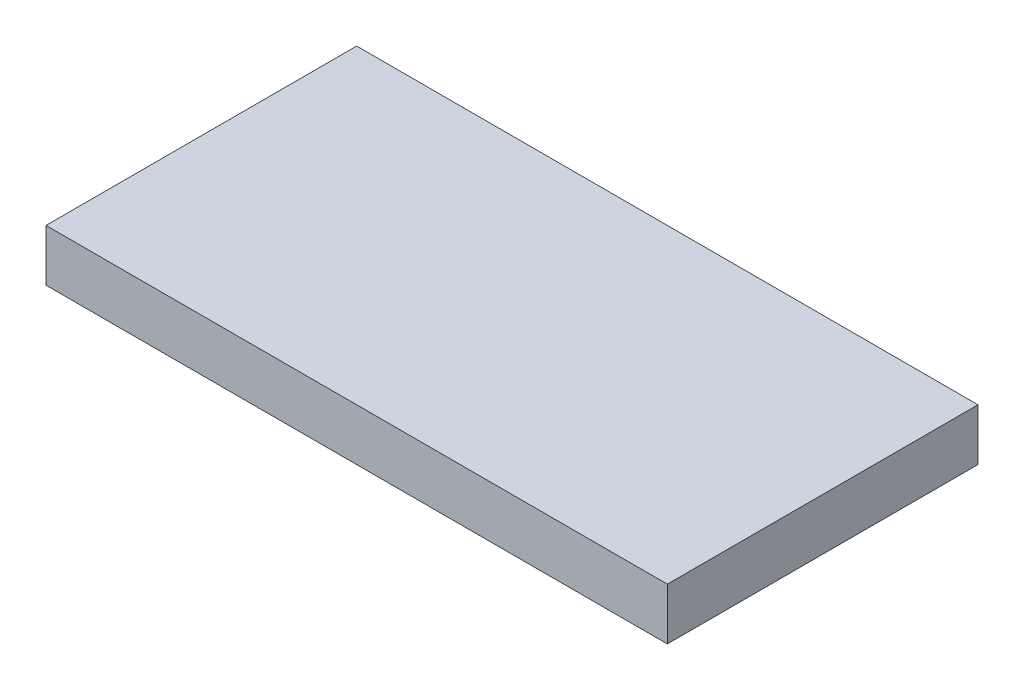
ISO-10303-21;
HEADER;
FILE_DESCRIPTION(('STEP AP214'),'2;1');
FILE_NAME('part.step','',(''),(''),'','','');
FILE_SCHEMA(('AUTOMOTIVE_DESIGN { 1 0 10303 214 1 1 1 1 }'));
ENDSEC;
DATA;
#1=APPLICATION_CONTEXT('core data for automotive mechanical design processes');
#2=APPLICATION_PROTOCOL_DEFINITION('international standard','automotive_design',2000,#1);
#3=PRODUCT_CONTEXT('',#1,'mechanical');
#4=PRODUCT('Part','Part','',(#3));
#5=PRODUCT_RELATED_PRODUCT_CATEGORY('part','',(#4));
#6=PRODUCT_DEFINITION_FORMATION('','',#4);
#7=PRODUCT_DEFINITION_CONTEXT('part definition',#1,'design');
#8=PRODUCT_DEFINITION('design','',#6,#7);
#9=PRODUCT_DEFINITION_SHAPE('','',#8);
#10=(LENGTH_UNIT() NAMED_UNIT(*) SI_UNIT(.MILLI.,.METRE.));
#11=(NAMED_UNIT(*) PLANE_ANGLE_UNIT() SI_UNIT($,.RADIAN.));
#12=(NAMED_UNIT(*) SI_UNIT($,.STERADIAN.) SOLID_ANGLE_UNIT());
#13=UNCERTAINTY_MEASURE_WITH_UNIT(LENGTH_MEASURE(1.E-05),#10,'distance_accuracy_value','');
#14=(GEOMETRIC_REPRESENTATION_CONTEXT(3) GLOBAL_UNCERTAINTY_ASSIGNED_CONTEXT((#13)) GLOBAL_UNIT_ASSIGNED_CONTEXT((#10,
#11,#12)) REPRESENTATION_CONTEXT('',''));
#15=CARTESIAN_POINT('',(0.,0.,0.));
#16=DIRECTION('',(0.,0.,1.));
#17=DIRECTION('',(1.,0.,0.));
#18=AXIS2_PLACEMENT_3D('',#15,#16,#17);
#19=CARTESIAN_POINT('',(-152.4,12.7,-76.2));
#20=DIRECTION('',(1.,0.,0.));
#21=DIRECTION('',(0.,0.,-1.));
#22=AXIS2_PLACEMENT_3D('',#19,#20,#21);
#23=PLANE('',#22);
#24=DIRECTION('',(0.,0.,1.));
#25=VECTOR('',#24,1.);
#26=CARTESIAN_POINT('',(-152.4,-12.7,-76.2));
#27=LINE('',#26,#25);
#28=CARTESIAN_POINT('',(-152.4,-12.7,-76.2));
#29=VERTEX_POINT('',#28);
#30=CARTESIAN_POINT('',(-152.4,-12.7,76.2));
#31=VERTEX_POINT('',#30);
#32=EDGE_CURVE('E96',#29,#31,#27,.T.);
#33=ORIENTED_EDGE('',*,*,#32,.T.);
#34=DIRECTION('',(0.,-1.,0.));
#35=VECTOR('',#34,1.);
#36=CARTESIAN_POINT('',(-152.4,12.7,76.2));
#37=LINE('',#36,#35);
#38=CARTESIAN_POINT('',(-152.4,12.7,76.2));
#39=VERTEX_POINT('',#38);
#40=EDGE_CURVE('E11',#39,#31,#37,.T.);
#41=ORIENTED_EDGE('',*,*,#40,.F.);
#42=DIRECTION('',(0.,0.,1.));
#43=VECTOR('',#42,1.);
#44=CARTESIAN_POINT('',(-152.4,12.7,-76.2));
#45=LINE('',#44,#43);
#46=CARTESIAN_POINT('',(-152.4,12.7,-76.2));
#47=VERTEX_POINT('',#46);
#48=EDGE_CURVE('E84',#47,#39,#45,.T.);
#49=ORIENTED_EDGE('',*,*,#48,.F.);
#50=DIRECTION('',(0.,-1.,0.));
#51=VECTOR('',#50,1.);
#52=CARTESIAN_POINT('',(-152.4,12.7,-76.2));
#53=LINE('',#52,#51);
#54=EDGE_CURVE('E92',#47,#29,#53,.T.);
#55=ORIENTED_EDGE('',*,*,#54,.T.);
#56=EDGE_LOOP('',(#33,#41,#49,#55));
#57=FACE_BOUND('',#56,.T.);
#58=ADVANCED_FACE('F33',(#57),#23,.F.);
#59=CARTESIAN_POINT('',(-152.4,12.7,76.2));
#60=DIRECTION('',(0.,0.,-1.));
#61=DIRECTION('',(-1.,0.,0.));
#62=AXIS2_PLACEMENT_3D('',#59,#60,#61);
#63=PLANE('',#62);
#64=DIRECTION('',(1.,0.,0.));
#65=VECTOR('',#64,1.);
#66=CARTESIAN_POINT('',(-152.4,-12.7,76.2));
#67=LINE('',#66,#65);
#68=CARTESIAN_POINT('',(152.4,-12.7,76.2));
#69=VERTEX_POINT('',#68);
#70=EDGE_CURVE('E88',#31,#69,#67,.T.);
#71=ORIENTED_EDGE('',*,*,#70,.T.);
#72=DIRECTION('',(0.,-1.,0.));
#73=VECTOR('',#72,1.);
#74=CARTESIAN_POINT('',(152.4,12.7,76.2));
#75=LINE('',#74,#73);
#76=CARTESIAN_POINT('',(152.4,12.7,76.2));
#77=VERTEX_POINT('',#76);
#78=EDGE_CURVE('E41',#77,#69,#75,.T.);
#79=ORIENTED_EDGE('',*,*,#78,.F.);
#80=DIRECTION('',(1.,0.,0.));
#81=VECTOR('',#80,1.);
#82=CARTESIAN_POINT('',(-152.4,12.7,76.2));
#83=LINE('',#82,#81);
#84=EDGE_CURVE('E79',#39,#77,#83,.T.);
#85=ORIENTED_EDGE('',*,*,#84,.F.);
#86=ORIENTED_EDGE('',*,*,#40,.T.);
#87=EDGE_LOOP('',(#71,#79,#85,#86));
#88=FACE_BOUND('',#87,.T.);
#89=ADVANCED_FACE('F87',(#88),#63,.F.);
#90=CARTESIAN_POINT('',(152.4,12.7,-76.2));
#91=DIRECTION('',(-1.,0.,0.));
#92=DIRECTION('',(0.,0.,1.));
#93=AXIS2_PLACEMENT_3D('',#90,#91,#92);
#94=PLANE('',#93);
#95=DIRECTION('',(0.,0.,-1.));
#96=VECTOR('',#95,1.);
#97=CARTESIAN_POINT('',(152.4,-12.7,-76.2));
#98=LINE('',#97,#96);
#99=CARTESIAN_POINT('',(152.4,-12.7,-76.2));
#100=VERTEX_POINT('',#99);
#101=EDGE_CURVE('E66',#69,#100,#98,.T.);
#102=ORIENTED_EDGE('',*,*,#101,.T.);
#103=DIRECTION('',(0.,-1.,0.));
#104=VECTOR('',#103,1.);
#105=CARTESIAN_POINT('',(152.4,12.7,-76.2));
#106=LINE('',#105,#104);
#107=CARTESIAN_POINT('',(152.4,12.7,-76.2));
#108=VERTEX_POINT('',#107);
#109=EDGE_CURVE('E89',#108,#100,#106,.T.);
#110=ORIENTED_EDGE('',*,*,#109,.F.);
#111=DIRECTION('',(0.,0.,-1.));
#112=VECTOR('',#111,1.);
#113=CARTESIAN_POINT('',(152.4,12.7,-76.2));
#114=LINE('',#113,#112);
#115=EDGE_CURVE('E82',#77,#108,#114,.T.);
#116=ORIENTED_EDGE('',*,*,#115,.F.);
#117=ORIENTED_EDGE('',*,*,#78,.T.);
#118=EDGE_LOOP('',(#102,#110,#116,#117));
#119=FACE_BOUND('',#118,.T.);
#120=ADVANCED_FACE('F90',(#119),#94,.F.);
#121=CARTESIAN_POINT('',(-152.4,12.7,-76.2));
#122=DIRECTION('',(0.,0.,1.));
#123=DIRECTION('',(1.,0.,0.));
#124=AXIS2_PLACEMENT_3D('',#121,#122,#123);
#125=PLANE('',#124);
#126=DIRECTION('',(-1.,0.,0.));
#127=VECTOR('',#126,1.);
#128=CARTESIAN_POINT('',(-152.4,-12.7,-76.2));
#129=LINE('',#128,#127);
#130=EDGE_CURVE('E72',#100,#29,#129,.T.);
#131=ORIENTED_EDGE('',*,*,#130,.T.);
#132=ORIENTED_EDGE('',*,*,#54,.F.);
#133=DIRECTION('',(-1.,0.,0.));
#134=VECTOR('',#133,1.);
#135=CARTESIAN_POINT('',(-152.4,12.7,-76.2));
#136=LINE('',#135,#134);
#137=EDGE_CURVE('E49',#108,#47,#136,.T.);
#138=ORIENTED_EDGE('',*,*,#137,.F.);
#139=ORIENTED_EDGE('',*,*,#109,.T.);
#140=EDGE_LOOP('',(#131,#132,#138,#139));
#141=FACE_BOUND('',#140,.T.);
#142=ADVANCED_FACE('F103',(#141),#125,.F.);
#143=CARTESIAN_POINT('',(0.,12.7,0.));
#144=DIRECTION('',(0.,1.,0.));
#145=DIRECTION('',(0.,0.,1.));
#146=AXIS2_PLACEMENT_3D('',#143,#144,#145);
#147=PLANE('',#146);
#148=ORIENTED_EDGE('',*,*,#48,.T.);
#149=ORIENTED_EDGE('',*,*,#84,.T.);
#150=ORIENTED_EDGE('',*,*,#115,.T.);
#151=ORIENTED_EDGE('',*,*,#137,.T.);
#152=EDGE_LOOP('',(#148,#149,#150,#151));
#153=FACE_BOUND('',#152,.T.);
#154=ADVANCED_FACE('F80',(#153),#147,.T.);
#155=CARTESIAN_POINT('',(0.,-12.7,0.));
#156=DIRECTION('',(0.,1.,0.));
#157=DIRECTION('',(0.,0.,1.));
#158=AXIS2_PLACEMENT_3D('',#155,#156,#157);
#159=PLANE('',#158);
#160=ORIENTED_EDGE('',*,*,#32,.F.);
#161=ORIENTED_EDGE('',*,*,#130,.F.);
#162=ORIENTED_EDGE('',*,*,#101,.F.);
#163=ORIENTED_EDGE('',*,*,#70,.F.);
#164=EDGE_LOOP('',(#160,#161,#162,#163));
#165=FACE_BOUND('',#164,.T.);
#166=ADVANCED_FACE('F106',(#165),#159,.F.);
#167=CLOSED_SHELL('',(#58,#89,#120,#142,#154,#166));
#168=MANIFOLD_SOLID_BREP('B2',#167);
#169=ADVANCED_BREP_SHAPE_REPRESENTATION('',(#18,#168),#14);
#170=SHAPE_DEFINITION_REPRESENTATION(#9,#169);
ENDSEC;
END-ISO-10303-21;
